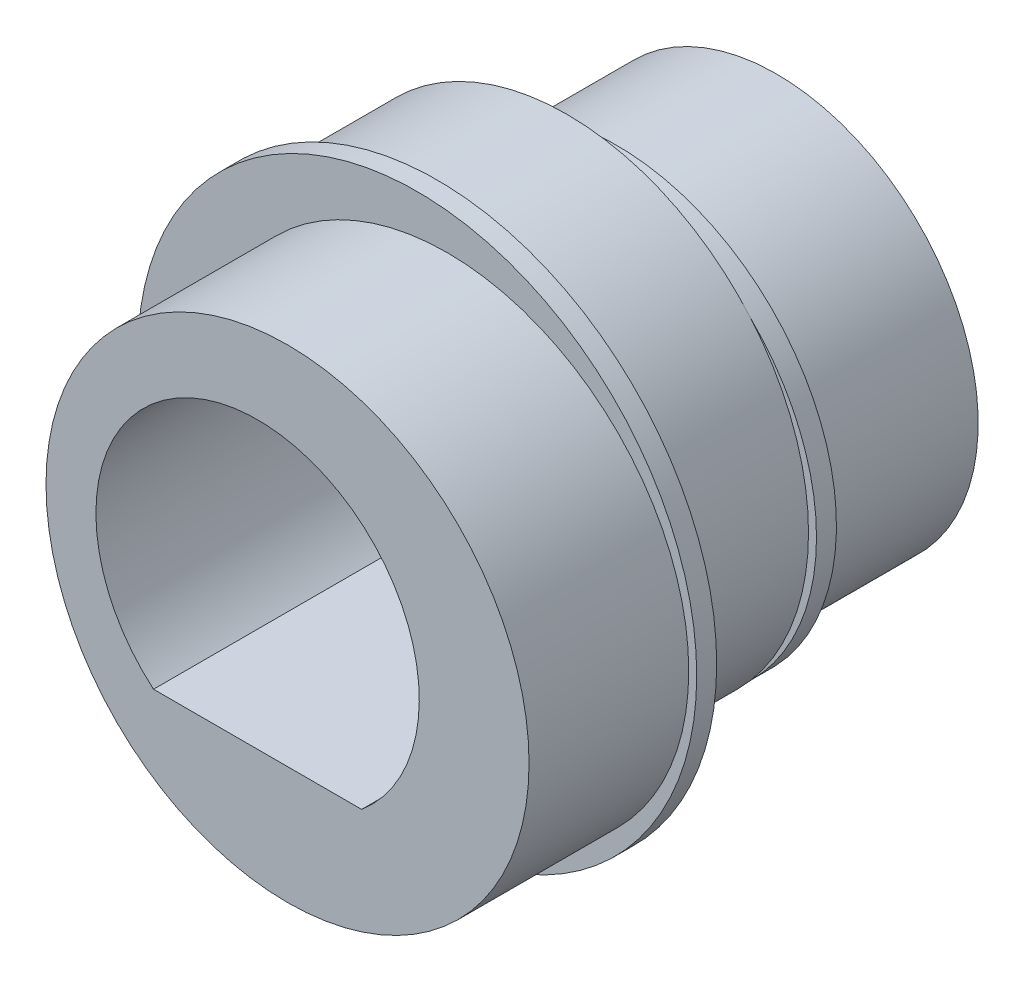
ISO-10303-21;
HEADER;
FILE_DESCRIPTION(('STEP AP214'),'2;1');
FILE_NAME('part.step','',(''),(''),'','','');
FILE_SCHEMA(('AUTOMOTIVE_DESIGN { 1 0 10303 214 1 1 1 1 }'));
ENDSEC;
DATA;
#1=APPLICATION_CONTEXT('core data for automotive mechanical design processes');
#2=APPLICATION_PROTOCOL_DEFINITION('international standard','automotive_design',2000,#1);
#3=PRODUCT_CONTEXT('',#1,'mechanical');
#4=PRODUCT('Part','Part','',(#3));
#5=PRODUCT_RELATED_PRODUCT_CATEGORY('part','',(#4));
#6=PRODUCT_DEFINITION_FORMATION('','',#4);
#7=PRODUCT_DEFINITION_CONTEXT('part definition',#1,'design');
#8=PRODUCT_DEFINITION('design','',#6,#7);
#9=PRODUCT_DEFINITION_SHAPE('','',#8);
#10=(LENGTH_UNIT() NAMED_UNIT(*) SI_UNIT(.MILLI.,.METRE.));
#11=(NAMED_UNIT(*) PLANE_ANGLE_UNIT() SI_UNIT($,.RADIAN.));
#12=(NAMED_UNIT(*) SI_UNIT($,.STERADIAN.) SOLID_ANGLE_UNIT());
#13=UNCERTAINTY_MEASURE_WITH_UNIT(LENGTH_MEASURE(1.E-05),#10,'distance_accuracy_value','');
#14=(GEOMETRIC_REPRESENTATION_CONTEXT(3) GLOBAL_UNCERTAINTY_ASSIGNED_CONTEXT((#13)) GLOBAL_UNIT_ASSIGNED_CONTEXT((#10,
#11,#12)) REPRESENTATION_CONTEXT('',''));
#15=CARTESIAN_POINT('',(0.,0.,0.));
#16=DIRECTION('',(0.,0.,1.));
#17=DIRECTION('',(1.,0.,0.));
#18=AXIS2_PLACEMENT_3D('',#15,#16,#17);
#19=CARTESIAN_POINT('',(-0.75,0.,4.));
#20=DIRECTION('',(0.,0.,-1.));
#21=DIRECTION('',(-1.,0.,0.));
#22=AXIS2_PLACEMENT_3D('',#19,#20,#21);
#23=CYLINDRICAL_SURFACE('',#22,6.05);
#24=CARTESIAN_POINT('',(-0.75,0.,4.));
#25=DIRECTION('',(0.,0.,1.));
#26=DIRECTION('',(1.,0.,0.));
#27=AXIS2_PLACEMENT_3D('',#24,#25,#26);
#28=CIRCLE('',#27,6.05);
#29=CARTESIAN_POINT('',(5.3,0.,4.));
#30=VERTEX_POINT('',#29);
#31=EDGE_CURVE('E108',#30,#30,#28,.T.);
#32=ORIENTED_EDGE('',*,*,#31,.F.);
#33=EDGE_LOOP('',(#32));
#34=FACE_BOUND('',#33,.T.);
#35=CARTESIAN_POINT('',(-0.75,0.,0.));
#36=DIRECTION('',(0.,0.,1.));
#37=DIRECTION('',(1.,0.,0.));
#38=AXIS2_PLACEMENT_3D('',#35,#36,#37);
#39=CIRCLE('',#38,6.05);
#40=CARTESIAN_POINT('',(3.86,3.91795865215548,0.));
#41=VERTEX_POINT('',#40);
#42=CARTESIAN_POINT('',(3.86,-3.91795865215548,0.));
#43=VERTEX_POINT('',#42);
#44=EDGE_CURVE('E42',#41,#43,#39,.T.);
#45=ORIENTED_EDGE('',*,*,#44,.T.);
#46=EDGE_CURVE('E112',#43,#41,#39,.T.);
#47=ORIENTED_EDGE('',*,*,#46,.T.);
#48=EDGE_LOOP('',(#45,#47));
#49=FACE_BOUND('',#48,.T.);
#50=ADVANCED_FACE('F39',(#34,#49),#23,.T.);
#51=CARTESIAN_POINT('',(-0.75,0.,0.));
#52=DIRECTION('',(0.,0.,1.));
#53=DIRECTION('',(1.,0.,0.));
#54=AXIS2_PLACEMENT_3D('',#51,#52,#53);
#55=PLANE('',#54);
#56=CARTESIAN_POINT('',(0.,0.,0.));
#57=DIRECTION('',(0.,0.,-1.));
#58=DIRECTION('',(-1.,0.,0.));
#59=AXIS2_PLACEMENT_3D('',#56,#57,#58);
#60=CIRCLE('',#59,5.5);
#61=EDGE_CURVE('E47',#43,#41,#60,.T.);
#62=ORIENTED_EDGE('',*,*,#61,.F.);
#63=ORIENTED_EDGE('',*,*,#44,.F.);
#64=EDGE_LOOP('',(#62,#63));
#65=FACE_BOUND('',#64,.T.);
#66=ADVANCED_FACE('F142',(#65),#55,.F.);
#67=CARTESIAN_POINT('',(0.,0.,4.5));
#68=DIRECTION('',(0.,0.,-1.));
#69=DIRECTION('',(-1.,0.,0.));
#70=AXIS2_PLACEMENT_3D('',#67,#68,#69);
#71=CYLINDRICAL_SURFACE('',#70,7.);
#72=CARTESIAN_POINT('',(0.,0.,4.5));
#73=DIRECTION('',(0.,0.,1.));
#74=DIRECTION('',(1.,0.,0.));
#75=AXIS2_PLACEMENT_3D('',#72,#73,#74);
#76=CIRCLE('',#75,7.);
#77=CARTESIAN_POINT('',(7.,0.,4.5));
#78=VERTEX_POINT('',#77);
#79=EDGE_CURVE('E109',#78,#78,#76,.T.);
#80=ORIENTED_EDGE('',*,*,#79,.F.);
#81=EDGE_LOOP('',(#80));
#82=FACE_BOUND('',#81,.T.);
#83=CARTESIAN_POINT('',(0.,0.,4.));
#84=DIRECTION('',(0.,0.,1.));
#85=DIRECTION('',(1.,0.,0.));
#86=AXIS2_PLACEMENT_3D('',#83,#84,#85);
#87=CIRCLE('',#86,7.);
#88=CARTESIAN_POINT('',(7.,0.,4.));
#89=VERTEX_POINT('',#88);
#90=EDGE_CURVE('E104',#89,#89,#87,.T.);
#91=ORIENTED_EDGE('',*,*,#90,.T.);
#92=EDGE_LOOP('',(#91));
#93=FACE_BOUND('',#92,.T.);
#94=ADVANCED_FACE('F147',(#82,#93),#71,.T.);
#95=CARTESIAN_POINT('',(0.,0.,4.5));
#96=DIRECTION('',(0.,0.,1.));
#97=DIRECTION('',(1.,0.,0.));
#98=AXIS2_PLACEMENT_3D('',#95,#96,#97);
#99=PLANE('',#98);
#100=CARTESIAN_POINT('',(0.75,0.,4.5));
#101=DIRECTION('',(0.,0.,1.));
#102=DIRECTION('',(1.,0.,0.));
#103=AXIS2_PLACEMENT_3D('',#100,#101,#102);
#104=CIRCLE('',#103,6.05);
#105=CARTESIAN_POINT('',(6.8,0.,4.5));
#106=VERTEX_POINT('',#105);
#107=EDGE_CURVE('E105',#106,#106,#104,.T.);
#108=ORIENTED_EDGE('',*,*,#107,.F.);
#109=EDGE_LOOP('',(#108));
#110=FACE_BOUND('',#109,.T.);
#111=ORIENTED_EDGE('',*,*,#79,.T.);
#112=EDGE_LOOP('',(#111));
#113=FACE_BOUND('',#112,.T.);
#114=ADVANCED_FACE('F151',(#110,#113),#99,.T.);
#115=CARTESIAN_POINT('',(0.,0.,4.));
#116=DIRECTION('',(0.,0.,1.));
#117=DIRECTION('',(1.,0.,0.));
#118=AXIS2_PLACEMENT_3D('',#115,#116,#117);
#119=PLANE('',#118);
#120=ORIENTED_EDGE('',*,*,#31,.T.);
#121=EDGE_LOOP('',(#120));
#122=FACE_BOUND('',#121,.T.);
#123=ORIENTED_EDGE('',*,*,#90,.F.);
#124=EDGE_LOOP('',(#123));
#125=FACE_BOUND('',#124,.T.);
#126=ADVANCED_FACE('F155',(#122,#125),#119,.F.);
#127=CARTESIAN_POINT('',(0.75,0.,8.5));
#128=DIRECTION('',(0.,0.,-1.));
#129=DIRECTION('',(-1.,0.,0.));
#130=AXIS2_PLACEMENT_3D('',#127,#128,#129);
#131=CYLINDRICAL_SURFACE('',#130,6.05);
#132=CARTESIAN_POINT('',(0.75,0.,8.5));
#133=DIRECTION('',(0.,0.,1.));
#134=DIRECTION('',(1.,0.,0.));
#135=AXIS2_PLACEMENT_3D('',#132,#133,#134);
#136=CIRCLE('',#135,6.05);
#137=CARTESIAN_POINT('',(6.8,0.,8.5));
#138=VERTEX_POINT('',#137);
#139=EDGE_CURVE('E99',#138,#138,#136,.T.);
#140=ORIENTED_EDGE('',*,*,#139,.F.);
#141=EDGE_LOOP('',(#140));
#142=FACE_BOUND('',#141,.T.);
#143=ORIENTED_EDGE('',*,*,#107,.T.);
#144=EDGE_LOOP('',(#143));
#145=FACE_BOUND('',#144,.T.);
#146=ADVANCED_FACE('F158',(#142,#145),#131,.T.);
#147=CARTESIAN_POINT('',(0.75,0.,8.5));
#148=DIRECTION('',(0.,0.,1.));
#149=DIRECTION('',(1.,0.,0.));
#150=AXIS2_PLACEMENT_3D('',#147,#148,#149);
#151=PLANE('',#150);
#152=DIRECTION('',(1.,0.,0.));
#153=VECTOR('',#152,1.);
#154=CARTESIAN_POINT('',(0.,-3.1,8.5));
#155=LINE('',#154,#153);
#156=CARTESIAN_POINT('',(-2.60624250598443,-3.1,8.5));
#157=VERTEX_POINT('',#156);
#158=CARTESIAN_POINT('',(2.60624250598443,-3.1,8.5));
#159=VERTEX_POINT('',#158);
#160=EDGE_CURVE('E55',#157,#159,#155,.T.);
#161=ORIENTED_EDGE('',*,*,#160,.F.);
#162=CARTESIAN_POINT('',(0.,0.,8.5));
#163=DIRECTION('',(0.,0.,1.));
#164=DIRECTION('',(1.,0.,0.));
#165=AXIS2_PLACEMENT_3D('',#162,#163,#164);
#166=CIRCLE('',#165,4.05);
#167=EDGE_CURVE('E86',#159,#157,#166,.T.);
#168=ORIENTED_EDGE('',*,*,#167,.F.);
#169=EDGE_LOOP('',(#161,#168));
#170=FACE_BOUND('',#169,.T.);
#171=ORIENTED_EDGE('',*,*,#139,.T.);
#172=EDGE_LOOP('',(#171));
#173=FACE_BOUND('',#172,.T.);
#174=ADVANCED_FACE('F164',(#170,#173),#151,.T.);
#175=CARTESIAN_POINT('',(0.,0.,-0.5));
#176=DIRECTION('',(0.,0.,1.));
#177=DIRECTION('',(1.,0.,0.));
#178=AXIS2_PLACEMENT_3D('',#175,#176,#177);
#179=CYLINDRICAL_SURFACE('',#178,5.5);
#180=CARTESIAN_POINT('',(0.,0.,-0.5));
#181=DIRECTION('',(0.,0.,-1.));
#182=DIRECTION('',(-1.,0.,0.));
#183=AXIS2_PLACEMENT_3D('',#180,#181,#182);
#184=CIRCLE('',#183,5.5);
#185=CARTESIAN_POINT('',(-5.5,0.,-0.5));
#186=VERTEX_POINT('',#185);
#187=EDGE_CURVE('E96',#186,#186,#184,.T.);
#188=ORIENTED_EDGE('',*,*,#187,.F.);
#189=EDGE_LOOP('',(#188));
#190=FACE_BOUND('',#189,.T.);
#191=EDGE_CURVE('E94',#41,#43,#60,.T.);
#192=ORIENTED_EDGE('',*,*,#191,.T.);
#193=ORIENTED_EDGE('',*,*,#61,.T.);
#194=EDGE_LOOP('',(#192,#193));
#195=FACE_BOUND('',#194,.T.);
#196=ADVANCED_FACE('F125',(#190,#195),#179,.T.);
#197=CARTESIAN_POINT('',(0.,0.,-0.5));
#198=DIRECTION('',(0.,0.,-1.));
#199=DIRECTION('',(-1.,0.,0.));
#200=AXIS2_PLACEMENT_3D('',#197,#198,#199);
#201=PLANE('',#200);
#202=CARTESIAN_POINT('',(0.,0.,-0.5));
#203=DIRECTION('',(0.,0.,-1.));
#204=DIRECTION('',(-1.,0.,0.));
#205=AXIS2_PLACEMENT_3D('',#202,#203,#204);
#206=CIRCLE('',#205,5.05);
#207=CARTESIAN_POINT('',(-5.05,0.,-0.5));
#208=VERTEX_POINT('',#207);
#209=EDGE_CURVE('E11',#208,#208,#206,.T.);
#210=ORIENTED_EDGE('',*,*,#209,.F.);
#211=EDGE_LOOP('',(#210));
#212=FACE_BOUND('',#211,.T.);
#213=ORIENTED_EDGE('',*,*,#187,.T.);
#214=EDGE_LOOP('',(#213));
#215=FACE_BOUND('',#214,.T.);
#216=ADVANCED_FACE('F130',(#212,#215),#201,.T.);
#217=CARTESIAN_POINT('',(0.,0.,0.));
#218=DIRECTION('',(0.,0.,-1.));
#219=DIRECTION('',(-1.,0.,0.));
#220=AXIS2_PLACEMENT_3D('',#217,#218,#219);
#221=PLANE('',#220);
#222=ORIENTED_EDGE('',*,*,#46,.F.);
#223=ORIENTED_EDGE('',*,*,#191,.F.);
#224=EDGE_LOOP('',(#222,#223));
#225=FACE_BOUND('',#224,.T.);
#226=ADVANCED_FACE('F127',(#225),#221,.F.);
#227=CARTESIAN_POINT('',(0.,0.,-4.5));
#228=DIRECTION('',(0.,0.,1.));
#229=DIRECTION('',(1.,0.,0.));
#230=AXIS2_PLACEMENT_3D('',#227,#228,#229);
#231=CYLINDRICAL_SURFACE('',#230,5.05);
#232=CARTESIAN_POINT('',(0.,0.,-4.5));
#233=DIRECTION('',(0.,0.,-1.));
#234=DIRECTION('',(-1.,0.,0.));
#235=AXIS2_PLACEMENT_3D('',#232,#233,#234);
#236=CIRCLE('',#235,5.05);
#237=CARTESIAN_POINT('',(-5.05,0.,-4.5));
#238=VERTEX_POINT('',#237);
#239=EDGE_CURVE('E91',#238,#238,#236,.T.);
#240=ORIENTED_EDGE('',*,*,#239,.F.);
#241=EDGE_LOOP('',(#240));
#242=FACE_BOUND('',#241,.T.);
#243=ORIENTED_EDGE('',*,*,#209,.T.);
#244=EDGE_LOOP('',(#243));
#245=FACE_BOUND('',#244,.T.);
#246=ADVANCED_FACE('F129',(#242,#245),#231,.T.);
#247=CARTESIAN_POINT('',(0.,0.,-4.5));
#248=DIRECTION('',(0.,0.,-1.));
#249=DIRECTION('',(-1.,0.,0.));
#250=AXIS2_PLACEMENT_3D('',#247,#248,#249);
#251=PLANE('',#250);
#252=DIRECTION('',(1.,0.,0.));
#253=VECTOR('',#252,1.);
#254=CARTESIAN_POINT('',(0.,-3.1,-4.5));
#255=LINE('',#254,#253);
#256=CARTESIAN_POINT('',(-2.60624250598443,-3.1,-4.5));
#257=VERTEX_POINT('',#256);
#258=CARTESIAN_POINT('',(2.60624250598443,-3.1,-4.5));
#259=VERTEX_POINT('',#258);
#260=EDGE_CURVE('E60',#257,#259,#255,.T.);
#261=ORIENTED_EDGE('',*,*,#260,.T.);
#262=CARTESIAN_POINT('',(0.,0.,-4.5));
#263=DIRECTION('',(0.,0.,1.));
#264=DIRECTION('',(1.,0.,0.));
#265=AXIS2_PLACEMENT_3D('',#262,#263,#264);
#266=CIRCLE('',#265,4.05);
#267=EDGE_CURVE('E78',#259,#257,#266,.T.);
#268=ORIENTED_EDGE('',*,*,#267,.T.);
#269=EDGE_LOOP('',(#261,#268));
#270=FACE_BOUND('',#269,.T.);
#271=ORIENTED_EDGE('',*,*,#239,.T.);
#272=EDGE_LOOP('',(#271));
#273=FACE_BOUND('',#272,.T.);
#274=ADVANCED_FACE('F84',(#270,#273),#251,.T.);
#275=CARTESIAN_POINT('',(0.,-3.1,-4.5));
#276=DIRECTION('',(0.,-1.,0.));
#277=DIRECTION('',(0.,0.,-1.));
#278=AXIS2_PLACEMENT_3D('',#275,#276,#277);
#279=PLANE('',#278);
#280=ORIENTED_EDGE('',*,*,#160,.T.);
#281=DIRECTION('',(0.,0.,1.));
#282=VECTOR('',#281,1.);
#283=CARTESIAN_POINT('',(2.60624250598443,-3.1,-4.5));
#284=LINE('',#283,#282);
#285=EDGE_CURVE('E71',#259,#159,#284,.T.);
#286=ORIENTED_EDGE('',*,*,#285,.F.);
#287=ORIENTED_EDGE('',*,*,#260,.F.);
#288=DIRECTION('',(0.,0.,1.));
#289=VECTOR('',#288,1.);
#290=CARTESIAN_POINT('',(-2.60624250598443,-3.1,-4.5));
#291=LINE('',#290,#289);
#292=EDGE_CURVE('E77',#257,#157,#291,.T.);
#293=ORIENTED_EDGE('',*,*,#292,.T.);
#294=EDGE_LOOP('',(#280,#286,#287,#293));
#295=FACE_BOUND('',#294,.T.);
#296=ADVANCED_FACE('F73',(#295),#279,.F.);
#297=CARTESIAN_POINT('',(0.,0.,-4.5));
#298=DIRECTION('',(0.,0.,1.));
#299=DIRECTION('',(1.,0.,0.));
#300=AXIS2_PLACEMENT_3D('',#297,#298,#299);
#301=CYLINDRICAL_SURFACE('',#300,4.05);
#302=ORIENTED_EDGE('',*,*,#167,.T.);
#303=ORIENTED_EDGE('',*,*,#292,.F.);
#304=ORIENTED_EDGE('',*,*,#267,.F.);
#305=ORIENTED_EDGE('',*,*,#285,.T.);
#306=EDGE_LOOP('',(#302,#303,#304,#305));
#307=FACE_BOUND('',#306,.T.);
#308=ADVANCED_FACE('F81',(#307),#301,.F.);
#309=CLOSED_SHELL('',(#50,#66,#94,#114,#126,#146,#174,#196,#216,#226,#246,#274,#296,#308));
#310=MANIFOLD_SOLID_BREP('B2',#309);
#311=ADVANCED_BREP_SHAPE_REPRESENTATION('',(#18,#310),#14);
#312=SHAPE_DEFINITION_REPRESENTATION(#9,#311);
ENDSEC;
END-ISO-10303-21;
